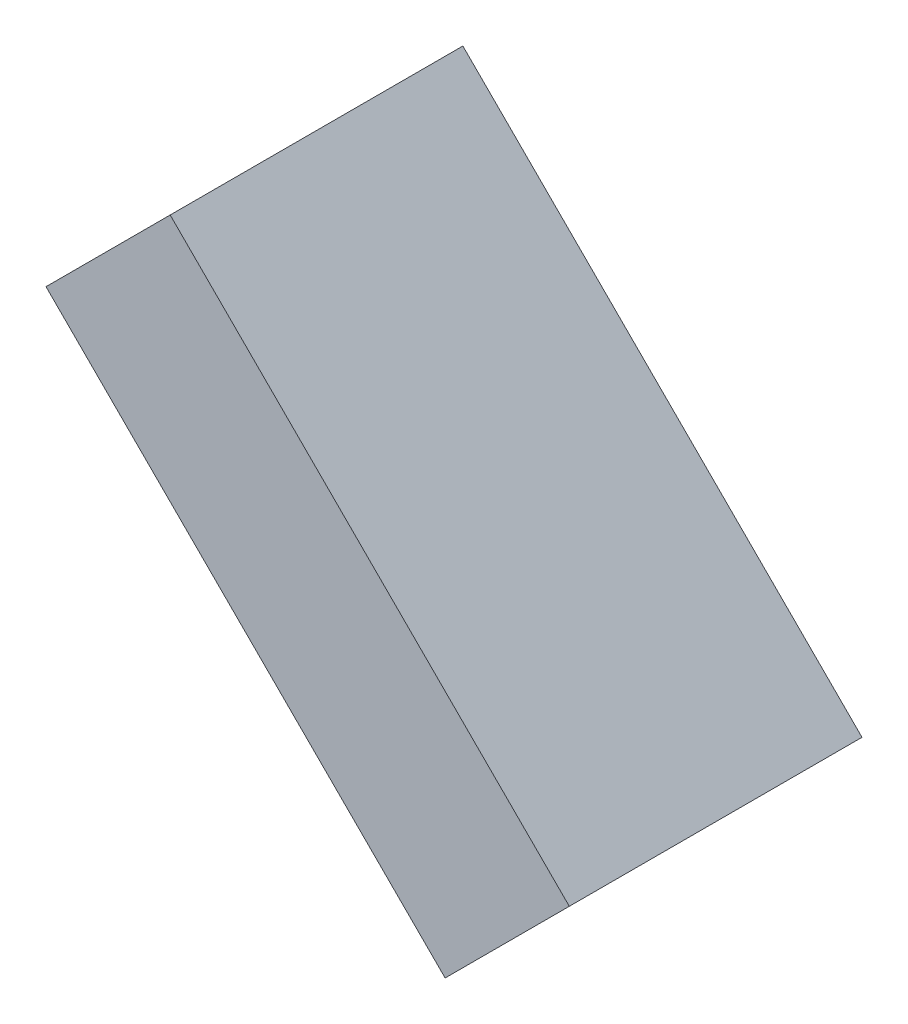
ISO-10303-21;
HEADER;
FILE_DESCRIPTION(('STEP AP214'),'2;1');
FILE_NAME('part.step','',(''),(''),'','','');
FILE_SCHEMA(('AUTOMOTIVE_DESIGN { 1 0 10303 214 1 1 1 1 }'));
ENDSEC;
DATA;
#1=APPLICATION_CONTEXT('core data for automotive mechanical design processes');
#2=APPLICATION_PROTOCOL_DEFINITION('international standard','automotive_design',2000,#1);
#3=PRODUCT_CONTEXT('',#1,'mechanical');
#4=PRODUCT('Part','Part','',(#3));
#5=PRODUCT_RELATED_PRODUCT_CATEGORY('part','',(#4));
#6=PRODUCT_DEFINITION_FORMATION('','',#4);
#7=PRODUCT_DEFINITION_CONTEXT('part definition',#1,'design');
#8=PRODUCT_DEFINITION('design','',#6,#7);
#9=PRODUCT_DEFINITION_SHAPE('','',#8);
#10=(LENGTH_UNIT() NAMED_UNIT(*) SI_UNIT(.MILLI.,.METRE.));
#11=(NAMED_UNIT(*) PLANE_ANGLE_UNIT() SI_UNIT($,.RADIAN.));
#12=(NAMED_UNIT(*) SI_UNIT($,.STERADIAN.) SOLID_ANGLE_UNIT());
#13=UNCERTAINTY_MEASURE_WITH_UNIT(LENGTH_MEASURE(1.E-05),#10,'distance_accuracy_value','');
#14=(GEOMETRIC_REPRESENTATION_CONTEXT(3) GLOBAL_UNCERTAINTY_ASSIGNED_CONTEXT((#13)) GLOBAL_UNIT_ASSIGNED_CONTEXT((#10,
#11,#12)) REPRESENTATION_CONTEXT('',''));
#15=CARTESIAN_POINT('',(0.,0.,0.));
#16=DIRECTION('',(0.,0.,1.));
#17=DIRECTION('',(1.,0.,0.));
#18=AXIS2_PLACEMENT_3D('',#15,#16,#17);
#19=CARTESIAN_POINT('',(-0.328803,0.62578996,0.));
#20=DIRECTION('',(0.707106781186548,0.707106781186548,0.));
#21=DIRECTION('',(0.707106781186548,-0.707106781186548,0.));
#22=AXIS2_PLACEMENT_3D('',#19,#20,#21);
#23=PLANE('',#22);
#24=DIRECTION('',(0.,0.,1.));
#25=VECTOR('',#24,1.);
#26=CARTESIAN_POINT('',(-0.328803,0.62578996,0.));
#27=LINE('',#26,#25);
#28=CARTESIAN_POINT('',(-0.328803,0.62578996,0.));
#29=VERTEX_POINT('',#28);
#30=CARTESIAN_POINT('',(-0.328803,0.62578996,0.70000114));
#31=VERTEX_POINT('',#30);
#32=EDGE_CURVE('E11',#29,#31,#27,.T.);
#33=ORIENTED_EDGE('',*,*,#32,.T.);
#34=DIRECTION('',(0.707106781186548,-0.707106781186548,0.));
#35=VECTOR('',#34,1.);
#36=CARTESIAN_POINT('',(-0.328803,0.62578996,0.70000114));
#37=LINE('',#36,#35);
#38=CARTESIAN_POINT('',(0.62578996,-0.328803,0.70000114));
#39=VERTEX_POINT('',#38);
#40=EDGE_CURVE('E24',#31,#39,#37,.T.);
#41=ORIENTED_EDGE('',*,*,#40,.T.);
#42=DIRECTION('',(0.,0.,1.));
#43=VECTOR('',#42,1.);
#44=CARTESIAN_POINT('',(0.62578996,-0.328803,0.));
#45=LINE('',#44,#43);
#46=CARTESIAN_POINT('',(0.62578996,-0.328803,0.));
#47=VERTEX_POINT('',#46);
#48=EDGE_CURVE('E85',#47,#39,#45,.T.);
#49=ORIENTED_EDGE('',*,*,#48,.F.);
#50=DIRECTION('',(0.707106781186548,-0.707106781186548,0.));
#51=VECTOR('',#50,1.);
#52=CARTESIAN_POINT('',(-0.328803,0.62578996,0.));
#53=LINE('',#52,#51);
#54=EDGE_CURVE('E83',#29,#47,#53,.T.);
#55=ORIENTED_EDGE('',*,*,#54,.F.);
#56=EDGE_LOOP('',(#33,#41,#49,#55));
#57=FACE_BOUND('',#56,.T.);
#58=ADVANCED_FACE('F17',(#57),#23,.T.);
#59=CARTESIAN_POINT('',(0.62578996,-0.328803,0.));
#60=DIRECTION('',(0.707106781186548,-0.707106781186548,0.));
#61=DIRECTION('',(-0.707106781186548,-0.707106781186548,0.));
#62=AXIS2_PLACEMENT_3D('',#59,#60,#61);
#63=PLANE('',#62);
#64=ORIENTED_EDGE('',*,*,#48,.T.);
#65=DIRECTION('',(-0.707106781186548,-0.707106781186548,0.));
#66=VECTOR('',#65,1.);
#67=CARTESIAN_POINT('',(0.62578996,-0.328803,0.70000114));
#68=LINE('',#67,#66);
#69=CARTESIAN_POINT('',(0.32880554,-0.62578742,0.70000114));
#70=VERTEX_POINT('',#69);
#71=EDGE_CURVE('E81',#39,#70,#68,.T.);
#72=ORIENTED_EDGE('',*,*,#71,.T.);
#73=DIRECTION('',(0.,0.,1.));
#74=VECTOR('',#73,1.);
#75=CARTESIAN_POINT('',(0.32880554,-0.62578742,0.));
#76=LINE('',#75,#74);
#77=CARTESIAN_POINT('',(0.32880554,-0.62578742,0.));
#78=VERTEX_POINT('',#77);
#79=EDGE_CURVE('E79',#78,#70,#76,.T.);
#80=ORIENTED_EDGE('',*,*,#79,.F.);
#81=DIRECTION('',(-0.707106781186548,-0.707106781186548,0.));
#82=VECTOR('',#81,1.);
#83=CARTESIAN_POINT('',(0.62578996,-0.328803,0.));
#84=LINE('',#83,#82);
#85=EDGE_CURVE('E70',#47,#78,#84,.T.);
#86=ORIENTED_EDGE('',*,*,#85,.F.);
#87=EDGE_LOOP('',(#64,#72,#80,#86));
#88=FACE_BOUND('',#87,.T.);
#89=ADVANCED_FACE('F90',(#88),#63,.T.);
#90=CARTESIAN_POINT('',(0.32880554,-0.62578742,0.));
#91=DIRECTION('',(-0.707106781186548,-0.707106781186548,0.));
#92=DIRECTION('',(-0.707106781186548,0.707106781186548,0.));
#93=AXIS2_PLACEMENT_3D('',#90,#91,#92);
#94=PLANE('',#93);
#95=ORIENTED_EDGE('',*,*,#79,.T.);
#96=DIRECTION('',(-0.707106781186548,0.707106781186548,0.));
#97=VECTOR('',#96,1.);
#98=CARTESIAN_POINT('',(0.32880554,-0.62578742,0.70000114));
#99=LINE('',#98,#97);
#100=CARTESIAN_POINT('',(-0.62578742,0.32880554,0.70000114));
#101=VERTEX_POINT('',#100);
#102=EDGE_CURVE('E60',#70,#101,#99,.T.);
#103=ORIENTED_EDGE('',*,*,#102,.T.);
#104=DIRECTION('',(0.,0.,1.));
#105=VECTOR('',#104,1.);
#106=CARTESIAN_POINT('',(-0.62578742,0.32880554,0.));
#107=LINE('',#106,#105);
#108=CARTESIAN_POINT('',(-0.62578742,0.32880554,0.));
#109=VERTEX_POINT('',#108);
#110=EDGE_CURVE('E54',#109,#101,#107,.T.);
#111=ORIENTED_EDGE('',*,*,#110,.F.);
#112=DIRECTION('',(-0.707106781186548,0.707106781186548,0.));
#113=VECTOR('',#112,1.);
#114=CARTESIAN_POINT('',(0.32880554,-0.62578742,0.));
#115=LINE('',#114,#113);
#116=EDGE_CURVE('E58',#78,#109,#115,.T.);
#117=ORIENTED_EDGE('',*,*,#116,.F.);
#118=EDGE_LOOP('',(#95,#103,#111,#117));
#119=FACE_BOUND('',#118,.T.);
#120=ADVANCED_FACE('F57',(#119),#94,.T.);
#121=CARTESIAN_POINT('',(-0.62578742,0.32880554,0.));
#122=DIRECTION('',(-0.707106781186548,0.707106781186548,0.));
#123=DIRECTION('',(0.707106781186548,0.707106781186548,0.));
#124=AXIS2_PLACEMENT_3D('',#121,#122,#123);
#125=PLANE('',#124);
#126=ORIENTED_EDGE('',*,*,#110,.T.);
#127=DIRECTION('',(0.707106781186548,0.707106781186548,0.));
#128=VECTOR('',#127,1.);
#129=CARTESIAN_POINT('',(-0.62578742,0.32880554,0.70000114));
#130=LINE('',#129,#128);
#131=EDGE_CURVE('E71',#101,#31,#130,.T.);
#132=ORIENTED_EDGE('',*,*,#131,.T.);
#133=ORIENTED_EDGE('',*,*,#32,.F.);
#134=DIRECTION('',(0.707106781186548,0.707106781186548,0.));
#135=VECTOR('',#134,1.);
#136=CARTESIAN_POINT('',(-0.62578742,0.32880554,0.));
#137=LINE('',#136,#135);
#138=EDGE_CURVE('E68',#109,#29,#137,.T.);
#139=ORIENTED_EDGE('',*,*,#138,.F.);
#140=EDGE_LOOP('',(#126,#132,#133,#139));
#141=FACE_BOUND('',#140,.T.);
#142=ADVANCED_FACE('F73',(#141),#125,.T.);
#143=CARTESIAN_POINT('',(-0.328803,0.62578996,0.));
#144=DIRECTION('',(0.,0.,1.));
#145=DIRECTION('',(1.,0.,0.));
#146=AXIS2_PLACEMENT_3D('',#143,#144,#145);
#147=PLANE('',#146);
#148=ORIENTED_EDGE('',*,*,#54,.T.);
#149=ORIENTED_EDGE('',*,*,#85,.T.);
#150=ORIENTED_EDGE('',*,*,#116,.T.);
#151=ORIENTED_EDGE('',*,*,#138,.T.);
#152=EDGE_LOOP('',(#148,#149,#150,#151));
#153=FACE_BOUND('',#152,.T.);
#154=ADVANCED_FACE('F67',(#153),#147,.F.);
#155=CARTESIAN_POINT('',(-0.328803,0.62578996,0.70000114));
#156=DIRECTION('',(0.,0.,1.));
#157=DIRECTION('',(1.,0.,0.));
#158=AXIS2_PLACEMENT_3D('',#155,#156,#157);
#159=PLANE('',#158);
#160=ORIENTED_EDGE('',*,*,#131,.F.);
#161=ORIENTED_EDGE('',*,*,#102,.F.);
#162=ORIENTED_EDGE('',*,*,#71,.F.);
#163=ORIENTED_EDGE('',*,*,#40,.F.);
#164=EDGE_LOOP('',(#160,#161,#162,#163));
#165=FACE_BOUND('',#164,.T.);
#166=ADVANCED_FACE('F91',(#165),#159,.T.);
#167=CLOSED_SHELL('',(#58,#89,#120,#142,#154,#166));
#168=MANIFOLD_SOLID_BREP('B1',#167);
#169=ADVANCED_BREP_SHAPE_REPRESENTATION('',(#18,#168),#14);
#170=SHAPE_DEFINITION_REPRESENTATION(#9,#169);
ENDSEC;
END-ISO-10303-21;
